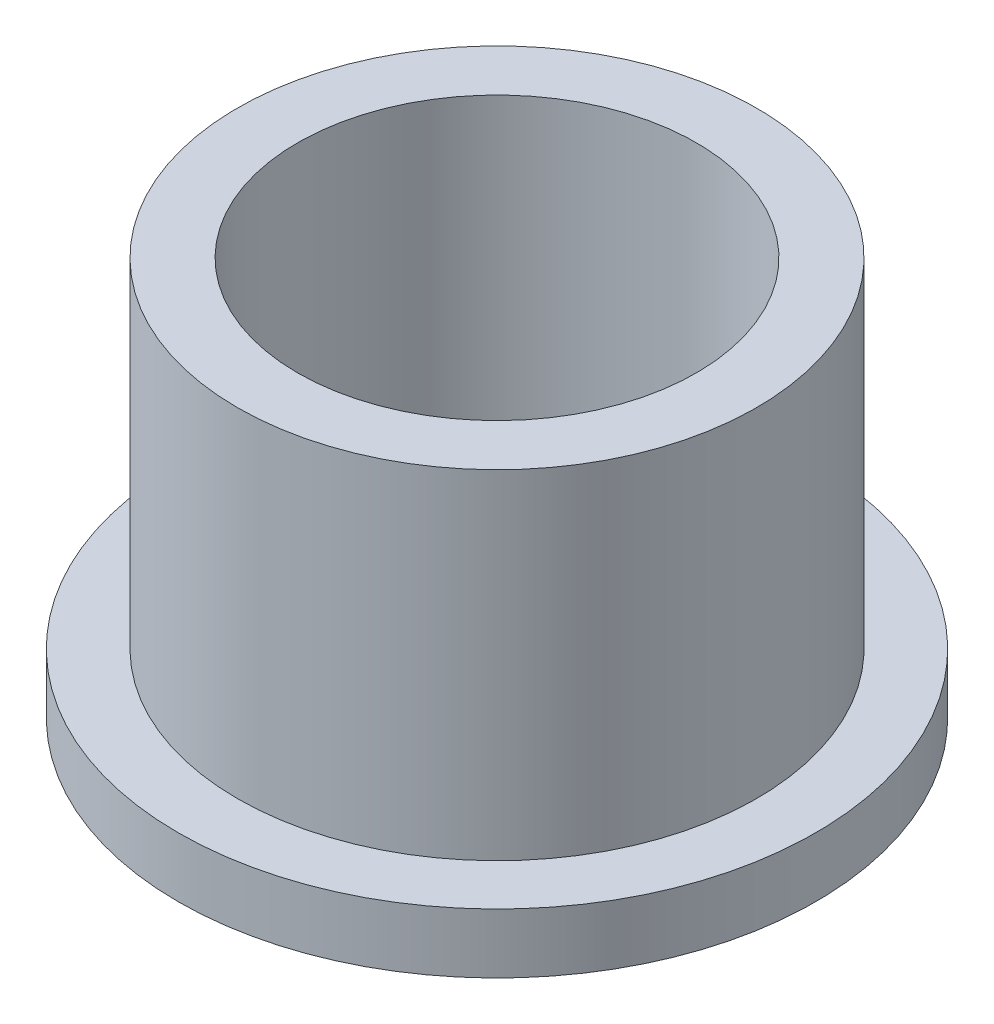
ISO-10303-21;
HEADER;
FILE_DESCRIPTION(('STEP AP214'),'2;1');
FILE_NAME('part.step','',(''),(''),'','','');
FILE_SCHEMA(('AUTOMOTIVE_DESIGN { 1 0 10303 214 1 1 1 1 }'));
ENDSEC;
DATA;
#1=APPLICATION_CONTEXT('core data for automotive mechanical design processes');
#2=APPLICATION_PROTOCOL_DEFINITION('international standard','automotive_design',2000,#1);
#3=PRODUCT_CONTEXT('',#1,'mechanical');
#4=PRODUCT('Part','Part','',(#3));
#5=PRODUCT_RELATED_PRODUCT_CATEGORY('part','',(#4));
#6=PRODUCT_DEFINITION_FORMATION('','',#4);
#7=PRODUCT_DEFINITION_CONTEXT('part definition',#1,'design');
#8=PRODUCT_DEFINITION('design','',#6,#7);
#9=PRODUCT_DEFINITION_SHAPE('','',#8);
#10=(LENGTH_UNIT() NAMED_UNIT(*) SI_UNIT(.MILLI.,.METRE.));
#11=(NAMED_UNIT(*) PLANE_ANGLE_UNIT() SI_UNIT($,.RADIAN.));
#12=(NAMED_UNIT(*) SI_UNIT($,.STERADIAN.) SOLID_ANGLE_UNIT());
#13=UNCERTAINTY_MEASURE_WITH_UNIT(LENGTH_MEASURE(1.E-05),#10,'distance_accuracy_value','');
#14=(GEOMETRIC_REPRESENTATION_CONTEXT(3) GLOBAL_UNCERTAINTY_ASSIGNED_CONTEXT((#13)) GLOBAL_UNIT_ASSIGNED_CONTEXT((#10,
#11,#12)) REPRESENTATION_CONTEXT('',''));
#15=CARTESIAN_POINT('',(0.,0.,0.));
#16=DIRECTION('',(0.,0.,1.));
#17=DIRECTION('',(1.,0.,0.));
#18=AXIS2_PLACEMENT_3D('',#15,#16,#17);
#19=CARTESIAN_POINT('',(0.,10.,0.));
#20=DIRECTION('',(0.,1.,0.));
#21=DIRECTION('',(0.,0.,1.));
#22=AXIS2_PLACEMENT_3D('',#19,#20,#21);
#23=PLANE('',#22);
#24=CARTESIAN_POINT('',(0.,10.,0.));
#25=DIRECTION('',(0.,1.,0.));
#26=DIRECTION('',(0.,0.,1.));
#27=AXIS2_PLACEMENT_3D('',#24,#25,#26);
#28=CIRCLE('',#27,6.515);
#29=CARTESIAN_POINT('',(0.,10.,6.515));
#30=VERTEX_POINT('',#29);
#31=EDGE_CURVE('E10',#30,#30,#28,.T.);
#32=ORIENTED_EDGE('',*,*,#31,.T.);
#33=EDGE_LOOP('',(#32));
#34=FACE_BOUND('',#33,.T.);
#35=CARTESIAN_POINT('',(0.,10.,0.));
#36=DIRECTION('',(0.,1.,0.));
#37=DIRECTION('',(0.,0.,1.));
#38=AXIS2_PLACEMENT_3D('',#35,#36,#37);
#39=CIRCLE('',#38,5.005);
#40=CARTESIAN_POINT('',(0.,10.,5.005));
#41=VERTEX_POINT('',#40);
#42=EDGE_CURVE('E39',#41,#41,#39,.T.);
#43=ORIENTED_EDGE('',*,*,#42,.F.);
#44=EDGE_LOOP('',(#43));
#45=FACE_BOUND('',#44,.T.);
#46=ADVANCED_FACE('F32',(#34,#45),#23,.T.);
#47=CARTESIAN_POINT('',(0.,0.,0.));
#48=DIRECTION('',(0.,1.,0.));
#49=DIRECTION('',(0.,0.,1.));
#50=AXIS2_PLACEMENT_3D('',#47,#48,#49);
#51=PLANE('',#50);
#52=CARTESIAN_POINT('',(0.,0.,0.));
#53=DIRECTION('',(0.,1.,0.));
#54=DIRECTION('',(0.,0.,1.));
#55=AXIS2_PLACEMENT_3D('',#52,#53,#54);
#56=CIRCLE('',#55,5.005);
#57=CARTESIAN_POINT('',(0.,0.,5.005));
#58=VERTEX_POINT('',#57);
#59=EDGE_CURVE('E43',#58,#58,#56,.T.);
#60=ORIENTED_EDGE('',*,*,#59,.T.);
#61=EDGE_LOOP('',(#60));
#62=FACE_BOUND('',#61,.T.);
#63=CARTESIAN_POINT('',(0.,0.,0.));
#64=DIRECTION('',(0.,1.,0.));
#65=DIRECTION('',(0.,0.,1.));
#66=AXIS2_PLACEMENT_3D('',#63,#64,#65);
#67=CIRCLE('',#66,8.);
#68=CARTESIAN_POINT('',(0.,0.,8.));
#69=VERTEX_POINT('',#68);
#70=EDGE_CURVE('E50',#69,#69,#67,.T.);
#71=ORIENTED_EDGE('',*,*,#70,.F.);
#72=EDGE_LOOP('',(#71));
#73=FACE_BOUND('',#72,.T.);
#74=ADVANCED_FACE('F75',(#62,#73),#51,.F.);
#75=CARTESIAN_POINT('',(0.,10.,0.));
#76=DIRECTION('',(0.,-1.,0.));
#77=DIRECTION('',(0.,0.,-1.));
#78=AXIS2_PLACEMENT_3D('',#75,#76,#77);
#79=CYLINDRICAL_SURFACE('',#78,6.515);
#80=CARTESIAN_POINT('',(0.,1.5,0.));
#81=DIRECTION('',(0.,1.,0.));
#82=DIRECTION('',(0.,0.,1.));
#83=AXIS2_PLACEMENT_3D('',#80,#81,#82);
#84=CIRCLE('',#83,6.515);
#85=CARTESIAN_POINT('',(0.,1.5,6.515));
#86=VERTEX_POINT('',#85);
#87=EDGE_CURVE('E53',#86,#86,#84,.T.);
#88=ORIENTED_EDGE('',*,*,#87,.T.);
#89=EDGE_LOOP('',(#88));
#90=FACE_BOUND('',#89,.T.);
#91=ORIENTED_EDGE('',*,*,#31,.F.);
#92=EDGE_LOOP('',(#91));
#93=FACE_BOUND('',#92,.T.);
#94=ADVANCED_FACE('F34',(#90,#93),#79,.T.);
#95=CARTESIAN_POINT('',(0.,10.,0.));
#96=DIRECTION('',(0.,-1.,0.));
#97=DIRECTION('',(0.,0.,-1.));
#98=AXIS2_PLACEMENT_3D('',#95,#96,#97);
#99=CYLINDRICAL_SURFACE('',#98,5.005);
#100=ORIENTED_EDGE('',*,*,#42,.T.);
#101=EDGE_LOOP('',(#100));
#102=FACE_BOUND('',#101,.T.);
#103=ORIENTED_EDGE('',*,*,#59,.F.);
#104=EDGE_LOOP('',(#103));
#105=FACE_BOUND('',#104,.T.);
#106=ADVANCED_FACE('F64',(#102,#105),#99,.F.);
#107=CARTESIAN_POINT('',(0.,1.5,0.));
#108=DIRECTION('',(0.,1.,0.));
#109=DIRECTION('',(0.,0.,1.));
#110=AXIS2_PLACEMENT_3D('',#107,#108,#109);
#111=PLANE('',#110);
#112=CARTESIAN_POINT('',(0.,1.5,0.));
#113=DIRECTION('',(0.,1.,0.));
#114=DIRECTION('',(0.,0.,1.));
#115=AXIS2_PLACEMENT_3D('',#112,#113,#114);
#116=CIRCLE('',#115,8.);
#117=CARTESIAN_POINT('',(0.,1.5,8.));
#118=VERTEX_POINT('',#117);
#119=EDGE_CURVE('E48',#118,#118,#116,.T.);
#120=ORIENTED_EDGE('',*,*,#119,.T.);
#121=EDGE_LOOP('',(#120));
#122=FACE_BOUND('',#121,.T.);
#123=ORIENTED_EDGE('',*,*,#87,.F.);
#124=EDGE_LOOP('',(#123));
#125=FACE_BOUND('',#124,.T.);
#126=ADVANCED_FACE('F61',(#122,#125),#111,.T.);
#127=CARTESIAN_POINT('',(0.,1.5,0.));
#128=DIRECTION('',(0.,-1.,0.));
#129=DIRECTION('',(0.,0.,-1.));
#130=AXIS2_PLACEMENT_3D('',#127,#128,#129);
#131=CYLINDRICAL_SURFACE('',#130,8.);
#132=ORIENTED_EDGE('',*,*,#119,.F.);
#133=EDGE_LOOP('',(#132));
#134=FACE_BOUND('',#133,.T.);
#135=ORIENTED_EDGE('',*,*,#70,.T.);
#136=EDGE_LOOP('',(#135));
#137=FACE_BOUND('',#136,.T.);
#138=ADVANCED_FACE('F63',(#134,#137),#131,.T.);
#139=CLOSED_SHELL('',(#46,#74,#94,#106,#126,#138));
#140=MANIFOLD_SOLID_BREP('B2',#139);
#141=ADVANCED_BREP_SHAPE_REPRESENTATION('',(#18,#140),#14);
#142=SHAPE_DEFINITION_REPRESENTATION(#9,#141);
ENDSEC;
END-ISO-10303-21;
